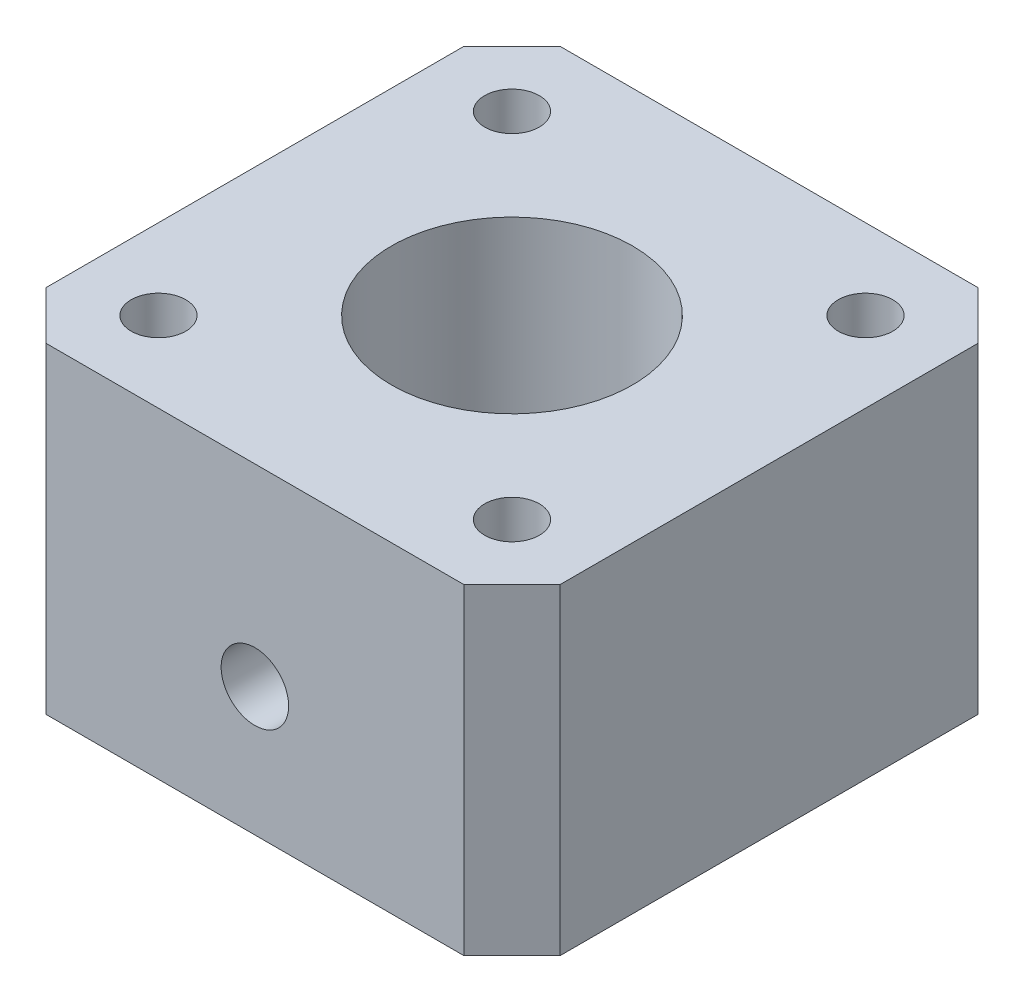
ISO-10303-21;
HEADER;
FILE_DESCRIPTION(('STEP AP214'),'2;1');
FILE_NAME('part.step','',(''),(''),'','','');
FILE_SCHEMA(('AUTOMOTIVE_DESIGN { 1 0 10303 214 1 1 1 1 }'));
ENDSEC;
DATA;
#1=APPLICATION_CONTEXT('core data for automotive mechanical design processes');
#2=APPLICATION_PROTOCOL_DEFINITION('international standard','automotive_design',2000,#1);
#3=PRODUCT_CONTEXT('',#1,'mechanical');
#4=PRODUCT('Part','Part','',(#3));
#5=PRODUCT_RELATED_PRODUCT_CATEGORY('part','',(#4));
#6=PRODUCT_DEFINITION_FORMATION('','',#4);
#7=PRODUCT_DEFINITION_CONTEXT('part definition',#1,'design');
#8=PRODUCT_DEFINITION('design','',#6,#7);
#9=PRODUCT_DEFINITION_SHAPE('','',#8);
#10=(LENGTH_UNIT() NAMED_UNIT(*) SI_UNIT(.MILLI.,.METRE.));
#11=(NAMED_UNIT(*) PLANE_ANGLE_UNIT() SI_UNIT($,.RADIAN.));
#12=(NAMED_UNIT(*) SI_UNIT($,.STERADIAN.) SOLID_ANGLE_UNIT());
#13=UNCERTAINTY_MEASURE_WITH_UNIT(LENGTH_MEASURE(1.E-05),#10,'distance_accuracy_value','');
#14=(GEOMETRIC_REPRESENTATION_CONTEXT(3) GLOBAL_UNCERTAINTY_ASSIGNED_CONTEXT((#13)) GLOBAL_UNIT_ASSIGNED_CONTEXT((#10,
#11,#12)) REPRESENTATION_CONTEXT('',''));
#15=CARTESIAN_POINT('',(0.,0.,0.));
#16=DIRECTION('',(0.,0.,1.));
#17=DIRECTION('',(1.,0.,0.));
#18=AXIS2_PLACEMENT_3D('',#15,#16,#17);
#19=CARTESIAN_POINT('',(0.,20.,0.));
#20=DIRECTION('',(0.,-1.,0.));
#21=DIRECTION('',(0.,0.,-1.));
#22=AXIS2_PLACEMENT_3D('',#19,#20,#21);
#23=PLANE('',#22);
#24=CARTESIAN_POINT('',(11.,20.,-11.));
#25=DIRECTION('',(0.,-1.,0.));
#26=DIRECTION('',(0.,0.,-1.));
#27=AXIS2_PLACEMENT_3D('',#24,#25,#26);
#28=CIRCLE('',#27,1.69999999999999);
#29=CARTESIAN_POINT('',(11.,20.,-12.7));
#30=VERTEX_POINT('',#29);
#31=EDGE_CURVE('E549',#30,#30,#28,.T.);
#32=ORIENTED_EDGE('',*,*,#31,.T.);
#33=EDGE_LOOP('',(#32));
#34=FACE_BOUND('',#33,.T.);
#35=CARTESIAN_POINT('',(-11.,20.,-11.));
#36=DIRECTION('',(0.,-1.,0.));
#37=DIRECTION('',(0.,0.,-1.));
#38=AXIS2_PLACEMENT_3D('',#35,#36,#37);
#39=CIRCLE('',#38,1.69999999999999);
#40=CARTESIAN_POINT('',(-11.,20.,-12.7));
#41=VERTEX_POINT('',#40);
#42=EDGE_CURVE('E533',#41,#41,#39,.T.);
#43=ORIENTED_EDGE('',*,*,#42,.T.);
#44=EDGE_LOOP('',(#43));
#45=FACE_BOUND('',#44,.T.);
#46=CARTESIAN_POINT('',(-11.,20.,11.));
#47=DIRECTION('',(0.,-1.,0.));
#48=DIRECTION('',(0.,0.,-1.));
#49=AXIS2_PLACEMENT_3D('',#46,#47,#48);
#50=CIRCLE('',#49,1.69999999999999);
#51=CARTESIAN_POINT('',(-11.,20.,9.30000000000001));
#52=VERTEX_POINT('',#51);
#53=EDGE_CURVE('E517',#52,#52,#50,.T.);
#54=ORIENTED_EDGE('',*,*,#53,.T.);
#55=EDGE_LOOP('',(#54));
#56=FACE_BOUND('',#55,.T.);
#57=CARTESIAN_POINT('',(11.,20.,11.));
#58=DIRECTION('',(0.,-1.,0.));
#59=DIRECTION('',(0.,0.,-1.));
#60=AXIS2_PLACEMENT_3D('',#57,#58,#59);
#61=CIRCLE('',#60,1.69999999999999);
#62=CARTESIAN_POINT('',(11.,20.,9.30000000000001));
#63=VERTEX_POINT('',#62);
#64=EDGE_CURVE('E499',#63,#63,#61,.T.);
#65=ORIENTED_EDGE('',*,*,#64,.T.);
#66=EDGE_LOOP('',(#65));
#67=FACE_BOUND('',#66,.T.);
#68=DIRECTION('',(-1.,0.,0.));
#69=VECTOR('',#68,1.);
#70=CARTESIAN_POINT('',(-13.,20.,-16.));
#71=LINE('',#70,#69);
#72=CARTESIAN_POINT('',(13.,20.,-16.));
#73=VERTEX_POINT('',#72);
#74=CARTESIAN_POINT('',(-13.,20.,-16.));
#75=VERTEX_POINT('',#74);
#76=EDGE_CURVE('E180',#73,#75,#71,.T.);
#77=ORIENTED_EDGE('',*,*,#76,.T.);
#78=DIRECTION('',(-0.707106781186547,0.,0.707106781186548));
#79=VECTOR('',#78,1.);
#80=CARTESIAN_POINT('',(-16.,20.,-13.));
#81=LINE('',#80,#79);
#82=CARTESIAN_POINT('',(-16.,20.,-13.));
#83=VERTEX_POINT('',#82);
#84=EDGE_CURVE('E116',#75,#83,#81,.T.);
#85=ORIENTED_EDGE('',*,*,#84,.T.);
#86=DIRECTION('',(0.,0.,1.));
#87=VECTOR('',#86,1.);
#88=CARTESIAN_POINT('',(-16.,20.,-13.));
#89=LINE('',#88,#87);
#90=CARTESIAN_POINT('',(-16.,20.,13.));
#91=VERTEX_POINT('',#90);
#92=EDGE_CURVE('E201',#83,#91,#89,.T.);
#93=ORIENTED_EDGE('',*,*,#92,.T.);
#94=DIRECTION('',(0.707106781186548,0.,0.707106781186547));
#95=VECTOR('',#94,1.);
#96=CARTESIAN_POINT('',(-16.,20.,13.));
#97=LINE('',#96,#95);
#98=CARTESIAN_POINT('',(-13.,20.,16.));
#99=VERTEX_POINT('',#98);
#100=EDGE_CURVE('E215',#91,#99,#97,.T.);
#101=ORIENTED_EDGE('',*,*,#100,.T.);
#102=DIRECTION('',(1.,0.,0.));
#103=VECTOR('',#102,1.);
#104=CARTESIAN_POINT('',(-13.,20.,16.));
#105=LINE('',#104,#103);
#106=CARTESIAN_POINT('',(13.,20.,16.));
#107=VERTEX_POINT('',#106);
#108=EDGE_CURVE('E135',#99,#107,#105,.T.);
#109=ORIENTED_EDGE('',*,*,#108,.T.);
#110=DIRECTION('',(0.707106781186547,0.,-0.707106781186547));
#111=VECTOR('',#110,1.);
#112=CARTESIAN_POINT('',(13.,20.,16.));
#113=LINE('',#112,#111);
#114=CARTESIAN_POINT('',(16.,20.,13.));
#115=VERTEX_POINT('',#114);
#116=EDGE_CURVE('E129',#107,#115,#113,.T.);
#117=ORIENTED_EDGE('',*,*,#116,.T.);
#118=DIRECTION('',(0.,0.,-1.));
#119=VECTOR('',#118,1.);
#120=CARTESIAN_POINT('',(16.,20.,-13.));
#121=LINE('',#120,#119);
#122=CARTESIAN_POINT('',(16.,20.,-13.));
#123=VERTEX_POINT('',#122);
#124=EDGE_CURVE('E133',#115,#123,#121,.T.);
#125=ORIENTED_EDGE('',*,*,#124,.T.);
#126=DIRECTION('',(-0.707106781186547,0.,-0.707106781186548));
#127=VECTOR('',#126,1.);
#128=CARTESIAN_POINT('',(13.,20.,-16.));
#129=LINE('',#128,#127);
#130=EDGE_CURVE('E73',#123,#73,#129,.T.);
#131=ORIENTED_EDGE('',*,*,#130,.T.);
#132=EDGE_LOOP('',(#77,#85,#93,#101,#109,#117,#125,#131));
#133=FACE_BOUND('',#132,.T.);
#134=CARTESIAN_POINT('',(0.,20.,0.));
#135=DIRECTION('',(0.,1.,0.));
#136=DIRECTION('',(0.,0.,1.));
#137=AXIS2_PLACEMENT_3D('',#134,#135,#136);
#138=CIRCLE('',#137,7.5);
#139=CARTESIAN_POINT('',(0.,20.,7.5));
#140=VERTEX_POINT('',#139);
#141=EDGE_CURVE('E162',#140,#140,#138,.T.);
#142=ORIENTED_EDGE('',*,*,#141,.F.);
#143=EDGE_LOOP('',(#142));
#144=FACE_BOUND('',#143,.T.);
#145=ADVANCED_FACE('F55',(#34,#45,#56,#67,#133,#144),#23,.F.);
#146=CARTESIAN_POINT('',(0.,0.,0.));
#147=DIRECTION('',(0.,-1.,0.));
#148=DIRECTION('',(0.,0.,-1.));
#149=AXIS2_PLACEMENT_3D('',#146,#147,#148);
#150=PLANE('',#149);
#151=CARTESIAN_POINT('',(11.,0.,-11.));
#152=DIRECTION('',(0.,-1.,0.));
#153=DIRECTION('',(0.,0.,-1.));
#154=AXIS2_PLACEMENT_3D('',#151,#152,#153);
#155=CIRCLE('',#154,3.25);
#156=CARTESIAN_POINT('',(11.,0.,-14.25));
#157=VERTEX_POINT('',#156);
#158=EDGE_CURVE('E560',#157,#157,#155,.T.);
#159=ORIENTED_EDGE('',*,*,#158,.F.);
#160=EDGE_LOOP('',(#159));
#161=FACE_BOUND('',#160,.T.);
#162=CARTESIAN_POINT('',(-11.,0.,-11.));
#163=DIRECTION('',(0.,-1.,0.));
#164=DIRECTION('',(0.,0.,-1.));
#165=AXIS2_PLACEMENT_3D('',#162,#163,#164);
#166=CIRCLE('',#165,3.25);
#167=CARTESIAN_POINT('',(-11.,0.,-14.25));
#168=VERTEX_POINT('',#167);
#169=EDGE_CURVE('E545',#168,#168,#166,.T.);
#170=ORIENTED_EDGE('',*,*,#169,.F.);
#171=EDGE_LOOP('',(#170));
#172=FACE_BOUND('',#171,.T.);
#173=CARTESIAN_POINT('',(-11.,0.,11.));
#174=DIRECTION('',(0.,-1.,0.));
#175=DIRECTION('',(0.,0.,-1.));
#176=AXIS2_PLACEMENT_3D('',#173,#174,#175);
#177=CIRCLE('',#176,3.25);
#178=CARTESIAN_POINT('',(-11.,0.,7.75000000000001));
#179=VERTEX_POINT('',#178);
#180=EDGE_CURVE('E529',#179,#179,#177,.T.);
#181=ORIENTED_EDGE('',*,*,#180,.F.);
#182=EDGE_LOOP('',(#181));
#183=FACE_BOUND('',#182,.T.);
#184=CARTESIAN_POINT('',(11.,0.,11.));
#185=DIRECTION('',(0.,-1.,0.));
#186=DIRECTION('',(0.,0.,-1.));
#187=AXIS2_PLACEMENT_3D('',#184,#185,#186);
#188=CIRCLE('',#187,3.25);
#189=CARTESIAN_POINT('',(11.,0.,7.75000000000001));
#190=VERTEX_POINT('',#189);
#191=EDGE_CURVE('E513',#190,#190,#188,.T.);
#192=ORIENTED_EDGE('',*,*,#191,.F.);
#193=EDGE_LOOP('',(#192));
#194=FACE_BOUND('',#193,.T.);
#195=DIRECTION('',(-1.,0.,0.));
#196=VECTOR('',#195,1.);
#197=CARTESIAN_POINT('',(-13.,0.,-16.));
#198=LINE('',#197,#196);
#199=CARTESIAN_POINT('',(13.,0.,-16.));
#200=VERTEX_POINT('',#199);
#201=CARTESIAN_POINT('',(-13.,0.,-16.));
#202=VERTEX_POINT('',#201);
#203=EDGE_CURVE('E157',#200,#202,#198,.T.);
#204=ORIENTED_EDGE('',*,*,#203,.F.);
#205=DIRECTION('',(-0.707106781186547,0.,-0.707106781186548));
#206=VECTOR('',#205,1.);
#207=CARTESIAN_POINT('',(13.,0.,-16.));
#208=LINE('',#207,#206);
#209=CARTESIAN_POINT('',(16.,0.,-13.));
#210=VERTEX_POINT('',#209);
#211=EDGE_CURVE('E108',#210,#200,#208,.T.);
#212=ORIENTED_EDGE('',*,*,#211,.F.);
#213=DIRECTION('',(0.,0.,-1.));
#214=VECTOR('',#213,1.);
#215=CARTESIAN_POINT('',(16.,0.,-13.));
#216=LINE('',#215,#214);
#217=CARTESIAN_POINT('',(16.,0.,13.));
#218=VERTEX_POINT('',#217);
#219=EDGE_CURVE('E102',#218,#210,#216,.T.);
#220=ORIENTED_EDGE('',*,*,#219,.F.);
#221=DIRECTION('',(0.707106781186547,0.,-0.707106781186547));
#222=VECTOR('',#221,1.);
#223=CARTESIAN_POINT('',(13.,0.,16.));
#224=LINE('',#223,#222);
#225=CARTESIAN_POINT('',(13.,0.,16.));
#226=VERTEX_POINT('',#225);
#227=EDGE_CURVE('E144',#226,#218,#224,.T.);
#228=ORIENTED_EDGE('',*,*,#227,.F.);
#229=DIRECTION('',(1.,0.,0.));
#230=VECTOR('',#229,1.);
#231=CARTESIAN_POINT('',(-13.,0.,16.));
#232=LINE('',#231,#230);
#233=CARTESIAN_POINT('',(-13.,0.,16.));
#234=VERTEX_POINT('',#233);
#235=EDGE_CURVE('E171',#234,#226,#232,.T.);
#236=ORIENTED_EDGE('',*,*,#235,.F.);
#237=DIRECTION('',(0.707106781186548,0.,0.707106781186547));
#238=VECTOR('',#237,1.);
#239=CARTESIAN_POINT('',(-16.,0.,13.));
#240=LINE('',#239,#238);
#241=CARTESIAN_POINT('',(-16.,0.,13.));
#242=VERTEX_POINT('',#241);
#243=EDGE_CURVE('E168',#242,#234,#240,.T.);
#244=ORIENTED_EDGE('',*,*,#243,.F.);
#245=DIRECTION('',(0.,0.,1.));
#246=VECTOR('',#245,1.);
#247=CARTESIAN_POINT('',(-16.,0.,-13.));
#248=LINE('',#247,#246);
#249=CARTESIAN_POINT('',(-16.,0.,-13.));
#250=VERTEX_POINT('',#249);
#251=EDGE_CURVE('E165',#250,#242,#248,.T.);
#252=ORIENTED_EDGE('',*,*,#251,.F.);
#253=DIRECTION('',(-0.707106781186547,0.,0.707106781186548));
#254=VECTOR('',#253,1.);
#255=CARTESIAN_POINT('',(-16.,0.,-13.));
#256=LINE('',#255,#254);
#257=EDGE_CURVE('E161',#202,#250,#256,.T.);
#258=ORIENTED_EDGE('',*,*,#257,.F.);
#259=EDGE_LOOP('',(#204,#212,#220,#228,#236,#244,#252,#258));
#260=FACE_BOUND('',#259,.T.);
#261=CARTESIAN_POINT('',(0.,0.,0.));
#262=DIRECTION('',(0.,1.,0.));
#263=DIRECTION('',(0.,0.,1.));
#264=AXIS2_PLACEMENT_3D('',#261,#262,#263);
#265=CIRCLE('',#264,7.5);
#266=CARTESIAN_POINT('',(0.,0.,7.5));
#267=VERTEX_POINT('',#266);
#268=EDGE_CURVE('E225',#267,#267,#265,.T.);
#269=ORIENTED_EDGE('',*,*,#268,.T.);
#270=EDGE_LOOP('',(#269));
#271=FACE_BOUND('',#270,.T.);
#272=ADVANCED_FACE('F205',(#161,#172,#183,#194,#260,#271),#150,.T.);
#273=CARTESIAN_POINT('',(-13.,20.,-16.));
#274=DIRECTION('',(0.,0.,1.));
#275=DIRECTION('',(1.,0.,0.));
#276=AXIS2_PLACEMENT_3D('',#273,#274,#275);
#277=PLANE('',#276);
#278=ORIENTED_EDGE('',*,*,#203,.T.);
#279=DIRECTION('',(0.,-1.,0.));
#280=VECTOR('',#279,1.);
#281=CARTESIAN_POINT('',(-13.,20.,-16.));
#282=LINE('',#281,#280);
#283=EDGE_CURVE('E11',#75,#202,#282,.T.);
#284=ORIENTED_EDGE('',*,*,#283,.F.);
#285=ORIENTED_EDGE('',*,*,#76,.F.);
#286=DIRECTION('',(0.,-1.,0.));
#287=VECTOR('',#286,1.);
#288=CARTESIAN_POINT('',(13.,20.,-16.));
#289=LINE('',#288,#287);
#290=EDGE_CURVE('E153',#73,#200,#289,.T.);
#291=ORIENTED_EDGE('',*,*,#290,.T.);
#292=EDGE_LOOP('',(#278,#284,#285,#291));
#293=FACE_BOUND('',#292,.T.);
#294=ADVANCED_FACE('F57',(#293),#277,.F.);
#295=CARTESIAN_POINT('',(-16.,20.,-13.));
#296=DIRECTION('',(0.707106781186548,0.,0.707106781186547));
#297=DIRECTION('',(0.707106781186547,0.,-0.707106781186548));
#298=AXIS2_PLACEMENT_3D('',#295,#296,#297);
#299=PLANE('',#298);
#300=ORIENTED_EDGE('',*,*,#257,.T.);
#301=DIRECTION('',(0.,-1.,0.));
#302=VECTOR('',#301,1.);
#303=CARTESIAN_POINT('',(-16.,20.,-13.));
#304=LINE('',#303,#302);
#305=EDGE_CURVE('E65',#83,#250,#304,.T.);
#306=ORIENTED_EDGE('',*,*,#305,.F.);
#307=ORIENTED_EDGE('',*,*,#84,.F.);
#308=ORIENTED_EDGE('',*,*,#283,.T.);
#309=EDGE_LOOP('',(#300,#306,#307,#308));
#310=FACE_BOUND('',#309,.T.);
#311=ADVANCED_FACE('F327',(#310),#299,.F.);
#312=CARTESIAN_POINT('',(-16.,20.,-13.));
#313=DIRECTION('',(1.,0.,0.));
#314=DIRECTION('',(0.,0.,-1.));
#315=AXIS2_PLACEMENT_3D('',#312,#313,#314);
#316=PLANE('',#315);
#317=ORIENTED_EDGE('',*,*,#251,.T.);
#318=DIRECTION('',(0.,-1.,0.));
#319=VECTOR('',#318,1.);
#320=CARTESIAN_POINT('',(-16.,20.,13.));
#321=LINE('',#320,#319);
#322=EDGE_CURVE('E191',#91,#242,#321,.T.);
#323=ORIENTED_EDGE('',*,*,#322,.F.);
#324=ORIENTED_EDGE('',*,*,#92,.F.);
#325=ORIENTED_EDGE('',*,*,#305,.T.);
#326=EDGE_LOOP('',(#317,#323,#324,#325));
#327=FACE_BOUND('',#326,.T.);
#328=ADVANCED_FACE('F199',(#327),#316,.F.);
#329=CARTESIAN_POINT('',(-16.,20.,13.));
#330=DIRECTION('',(0.707106781186547,0.,-0.707106781186548));
#331=DIRECTION('',(-0.707106781186548,0.,-0.707106781186547));
#332=AXIS2_PLACEMENT_3D('',#329,#330,#331);
#333=PLANE('',#332);
#334=ORIENTED_EDGE('',*,*,#243,.T.);
#335=DIRECTION('',(0.,-1.,0.));
#336=VECTOR('',#335,1.);
#337=CARTESIAN_POINT('',(-13.,20.,16.));
#338=LINE('',#337,#336);
#339=EDGE_CURVE('E187',#99,#234,#338,.T.);
#340=ORIENTED_EDGE('',*,*,#339,.F.);
#341=ORIENTED_EDGE('',*,*,#100,.F.);
#342=ORIENTED_EDGE('',*,*,#322,.T.);
#343=EDGE_LOOP('',(#334,#340,#341,#342));
#344=FACE_BOUND('',#343,.T.);
#345=ADVANCED_FACE('F210',(#344),#333,.F.);
#346=CARTESIAN_POINT('',(-13.,20.,16.));
#347=DIRECTION('',(0.,0.,-1.));
#348=DIRECTION('',(-1.,0.,0.));
#349=AXIS2_PLACEMENT_3D('',#346,#347,#348);
#350=PLANE('',#349);
#351=CARTESIAN_POINT('',(0.,8.,16.));
#352=DIRECTION('',(0.,0.,1.));
#353=DIRECTION('',(1.,0.,0.));
#354=AXIS2_PLACEMENT_3D('',#351,#352,#353);
#355=CIRCLE('',#354,2.1);
#356=CARTESIAN_POINT('',(2.1,8.,16.));
#357=VERTEX_POINT('',#356);
#358=EDGE_CURVE('E241',#357,#357,#355,.T.);
#359=ORIENTED_EDGE('',*,*,#358,.F.);
#360=EDGE_LOOP('',(#359));
#361=FACE_BOUND('',#360,.T.);
#362=ORIENTED_EDGE('',*,*,#235,.T.);
#363=DIRECTION('',(0.,-1.,0.));
#364=VECTOR('',#363,1.);
#365=CARTESIAN_POINT('',(13.,20.,16.));
#366=LINE('',#365,#364);
#367=EDGE_CURVE('E146',#107,#226,#366,.T.);
#368=ORIENTED_EDGE('',*,*,#367,.F.);
#369=ORIENTED_EDGE('',*,*,#108,.F.);
#370=ORIENTED_EDGE('',*,*,#339,.T.);
#371=EDGE_LOOP('',(#362,#368,#369,#370));
#372=FACE_BOUND('',#371,.T.);
#373=ADVANCED_FACE('F213',(#361,#372),#350,.F.);
#374=CARTESIAN_POINT('',(13.,20.,16.));
#375=DIRECTION('',(-0.707106781186548,0.,-0.707106781186548));
#376=DIRECTION('',(-0.707106781186548,0.,0.707106781186548));
#377=AXIS2_PLACEMENT_3D('',#374,#375,#376);
#378=PLANE('',#377);
#379=ORIENTED_EDGE('',*,*,#227,.T.);
#380=DIRECTION('',(0.,-1.,0.));
#381=VECTOR('',#380,1.);
#382=CARTESIAN_POINT('',(16.,20.,13.));
#383=LINE('',#382,#381);
#384=EDGE_CURVE('E141',#115,#218,#383,.T.);
#385=ORIENTED_EDGE('',*,*,#384,.F.);
#386=ORIENTED_EDGE('',*,*,#116,.F.);
#387=ORIENTED_EDGE('',*,*,#367,.T.);
#388=EDGE_LOOP('',(#379,#385,#386,#387));
#389=FACE_BOUND('',#388,.T.);
#390=ADVANCED_FACE('F142',(#389),#378,.F.);
#391=CARTESIAN_POINT('',(16.,20.,-13.));
#392=DIRECTION('',(-1.,0.,0.));
#393=DIRECTION('',(0.,0.,1.));
#394=AXIS2_PLACEMENT_3D('',#391,#392,#393);
#395=PLANE('',#394);
#396=ORIENTED_EDGE('',*,*,#219,.T.);
#397=DIRECTION('',(0.,-1.,0.));
#398=VECTOR('',#397,1.);
#399=CARTESIAN_POINT('',(16.,20.,-13.));
#400=LINE('',#399,#398);
#401=EDGE_CURVE('E147',#123,#210,#400,.T.);
#402=ORIENTED_EDGE('',*,*,#401,.F.);
#403=ORIENTED_EDGE('',*,*,#124,.F.);
#404=ORIENTED_EDGE('',*,*,#384,.T.);
#405=EDGE_LOOP('',(#396,#402,#403,#404));
#406=FACE_BOUND('',#405,.T.);
#407=ADVANCED_FACE('F149',(#406),#395,.F.);
#408=CARTESIAN_POINT('',(13.,20.,-16.));
#409=DIRECTION('',(-0.707106781186548,0.,0.707106781186547));
#410=DIRECTION('',(0.707106781186547,0.,0.707106781186548));
#411=AXIS2_PLACEMENT_3D('',#408,#409,#410);
#412=PLANE('',#411);
#413=ORIENTED_EDGE('',*,*,#211,.T.);
#414=ORIENTED_EDGE('',*,*,#290,.F.);
#415=ORIENTED_EDGE('',*,*,#130,.F.);
#416=ORIENTED_EDGE('',*,*,#401,.T.);
#417=EDGE_LOOP('',(#413,#414,#415,#416));
#418=FACE_BOUND('',#417,.T.);
#419=ADVANCED_FACE('F314',(#418),#412,.F.);
#420=CARTESIAN_POINT('',(0.,20.,0.));
#421=DIRECTION('',(0.,-1.,0.));
#422=DIRECTION('',(0.,0.,-1.));
#423=AXIS2_PLACEMENT_3D('',#420,#421,#422);
#424=CYLINDRICAL_SURFACE('',#423,7.5);
#425=CARTESIAN_POINT('',(2.1,8.,7.2));
#426=CARTESIAN_POINT('',(2.09999769142372,7.88455110517132,7.20000175092611));
#427=CARTESIAN_POINT('',(2.090447258008,7.76907857532073,7.20280713265303));
#428=CARTESIAN_POINT('',(2.05258019102824,7.5414842875502,7.21368770991474));
#429=CARTESIAN_POINT('',(2.02425538445371,7.42936401118606,7.22176520052276));
#430=CARTESIAN_POINT('',(1.94985652031882,7.21180023988363,7.24220502233453));
#431=CARTESIAN_POINT('',(1.90380916683966,7.10634697618715,7.25456090412264));
#432=CARTESIAN_POINT('',(1.79535769220004,6.90464207606648,7.28215690109494));
#433=CARTESIAN_POINT('',(1.73295183131605,6.80839141982424,7.29739732300137));
#434=CARTESIAN_POINT('',(1.59171413202466,6.62517052416384,7.32951618449188));
#435=CARTESIAN_POINT('',(1.51251149606311,6.53849155407776,7.34642599336529));
#436=CARTESIAN_POINT('',(1.34072490285875,6.37945684799169,7.37970866753021));
#437=CARTESIAN_POINT('',(1.24813943745967,6.30710272848815,7.39608147204938));
#438=CARTESIAN_POINT('',(1.0501753641818,6.177537651625,7.42679785762245));
#439=CARTESIAN_POINT('',(0.944598390212243,6.12061913539018,7.44110013563313));
#440=CARTESIAN_POINT('',(0.72490474677135,6.02545309176847,7.46570231446394));
#441=CARTESIAN_POINT('',(0.610789675797224,5.98720207950076,7.4760029622418));
#442=CARTESIAN_POINT('',(0.380302236373025,5.93140772474192,7.49121941354851));
#443=CARTESIAN_POINT('',(0.264058623362754,5.91336823938435,7.49626401123117));
#444=CARTESIAN_POINT('',(0.0300927460088075,5.89694502126617,7.50085154395726));
#445=CARTESIAN_POINT('',(-0.08762924250508,5.89855767475153,7.50039549049382));
#446=CARTESIAN_POINT('',(-0.317746311518633,5.92104988331973,7.49412619131461));
#447=CARTESIAN_POINT('',(-0.430198522887034,5.94139293966687,7.48846212582118));
#448=CARTESIAN_POINT('',(-0.650024177765258,5.99989803930804,7.47259127690994));
#449=CARTESIAN_POINT('',(-0.757397317354174,6.03806114743458,7.4623842220287));
#450=CARTESIAN_POINT('',(-0.965349801263523,6.13151539355546,7.43835884069074));
#451=CARTESIAN_POINT('',(-1.06584470618675,6.18698444930544,7.42450324668395));
#452=CARTESIAN_POINT('',(-1.25627862457918,6.31333795993753,7.39466485562083));
#453=CARTESIAN_POINT('',(-1.34621539544036,6.38422568074331,7.37868160817165));
#454=CARTESIAN_POINT('',(-1.51618305590154,6.54222754355347,7.34567522057905));
#455=CARTESIAN_POINT('',(-1.59577717509012,6.62980858410341,7.32863518998309));
#456=CARTESIAN_POINT('',(-1.73926156835205,6.81724868645204,7.29591665217892));
#457=CARTESIAN_POINT('',(-1.80315067068666,6.91710866353899,7.28023824661686));
#458=CARTESIAN_POINT('',(-1.91379030231589,7.12729666999599,7.25194501002577));
#459=CARTESIAN_POINT('',(-1.96041048527216,7.23769670572155,7.23935371206725));
#460=CARTESIAN_POINT('',(-2.03427979371574,7.46521055278396,7.21894665875122));
#461=CARTESIAN_POINT('',(-2.0615342965447,7.58232249063324,7.21112957780356));
#462=CARTESIAN_POINT('',(-2.09512133703559,7.8158226539633,7.20144181427927));
#463=CARTESIAN_POINT('',(-2.10211023295227,7.93210882732001,7.19938465899453));
#464=CARTESIAN_POINT('',(-2.09678562260949,8.16419067902114,7.20093733719562));
#465=CARTESIAN_POINT('',(-2.08447441367737,8.27998641409829,7.20454649620961));
#466=CARTESIAN_POINT('',(-2.04148011473317,8.5051921119612,7.21684386770043));
#467=CARTESIAN_POINT('',(-2.01120230768185,8.61468617743715,7.22541993924817));
#468=CARTESIAN_POINT('',(-1.93359543214541,8.82703875928599,7.24657269498035));
#469=CARTESIAN_POINT('',(-1.88626397295673,8.92989634292425,7.25914994004911));
#470=CARTESIAN_POINT('',(-1.77459509136294,9.12877269761775,7.28726240690147));
#471=CARTESIAN_POINT('',(-1.70987813502039,9.224569166007,7.30286116048027));
#472=CARTESIAN_POINT('',(-1.56573803326783,9.40418314643846,7.33511474861878));
#473=CARTESIAN_POINT('',(-1.48631183008104,9.48799816133002,7.35176980228926));
#474=CARTESIAN_POINT('',(-1.31195238316687,9.64405083657379,7.38490975407121));
#475=CARTESIAN_POINT('',(-1.21660153256647,9.71582776949724,7.4013718288206));
#476=CARTESIAN_POINT('',(-1.01482822512431,9.84236295569935,7.43172364179825));
#477=CARTESIAN_POINT('',(-0.908406353625255,9.8971221081257,7.44561351591507));
#478=CARTESIAN_POINT('',(-0.68825562093122,9.98754923511424,7.46916678636433));
#479=CARTESIAN_POINT('',(-0.574589642969956,10.0233615963978,7.47886204186584));
#480=CARTESIAN_POINT('',(-0.342537614831909,10.0752817885412,7.4930742926061));
#481=CARTESIAN_POINT('',(-0.22415273423877,10.0913944710087,7.49759256280785));
#482=CARTESIAN_POINT('',(0.00969112124072257,10.10312839472,7.50087475153958));
#483=CARTESIAN_POINT('',(0.125114144971009,10.0994223040454,7.49982757425403));
#484=CARTESIAN_POINT('',(0.353626881036669,10.0732036113851,7.49253071356722));
#485=CARTESIAN_POINT('',(0.466716697254848,10.0506918485554,7.48628126230442));
#486=CARTESIAN_POINT('',(0.68645626937514,9.98789613958341,7.46932613881606));
#487=CARTESIAN_POINT('',(0.793151611784455,9.94776095431702,7.4586578085919));
#488=CARTESIAN_POINT('',(0.998353701041716,9.85098998719994,7.43397489084363));
#489=CARTESIAN_POINT('',(1.09685921135807,9.79435171944605,7.41995979924538));
#490=CARTESIAN_POINT('',(1.28596610763476,9.66428300177141,7.38956927564246));
#491=CARTESIAN_POINT('',(1.37625788128737,9.59041564694985,7.37313745973981));
#492=CARTESIAN_POINT('',(1.54339107601341,9.42879782153954,7.3399740390093));
#493=CARTESIAN_POINT('',(1.6202288270092,9.34104357518203,7.32324235374892));
#494=CARTESIAN_POINT('',(1.7601810081138,9.15151287771814,7.29088892650895));
#495=CARTESIAN_POINT('',(1.82290552428642,9.04944137267979,7.27530525828304));
#496=CARTESIAN_POINT('',(1.93021956053794,8.83577800875938,7.24757503896698));
#497=CARTESIAN_POINT('',(1.97481976673698,8.72419180685135,7.23542646383002));
#498=CARTESIAN_POINT('',(2.03947300884321,8.51101715035091,7.2174445712127));
#499=CARTESIAN_POINT('',(2.0621139131252,8.41026176112713,7.21095909202013));
#500=CARTESIAN_POINT('',(2.09237736458971,8.20634364291426,7.20223632826998));
#501=CARTESIAN_POINT('',(2.10000206326628,8.10318126093812,7.19999843512782));
#502=CARTESIAN_POINT('',(2.1,8.,7.2));
#503=B_SPLINE_CURVE_WITH_KNOTS('',3,(#425,#426,#427,#428,#429,#430,#431,#432,#433,#434,#435,
#436,#437,#438,#439,#440,#441,#442,#443,#444,#445,#446,#447,#448,#449,#450,#451,#452,#453,#454,
#455,#456,#457,#458,#459,#460,#461,#462,#463,#464,#465,#466,#467,#468,#469,#470,#471,#472,#473,
#474,#475,#476,#477,#478,#479,#480,#481,#482,#483,#484,#485,#486,#487,#488,#489,#490,#491,#492,
#493,#494,#495,#496,#497,#498,#499,#500,#501,#502),.UNSPECIFIED.,.T.,.F.,(4,2,2,2,2,2,2,2,2,2,2,
2,2,2,2,2,2,2,2,2,2,2,2,2,2,2,2,2,2,2,2,2,2,2,2,2,2,2,4),(0.,0.345966820679476,
0.692084349409679,1.03768238213022,1.3833171840449,1.73757082880147,2.09186442676818,
2.45246381411618,2.81299585839309,3.1644693582517,3.51587822801511,3.85752460211593,
4.19919139381877,4.54449343533439,4.88986868878041,5.24690042870958,5.60395879841149,
5.96365984094947,6.3232609648655,6.67107770948494,7.01885305597464,7.35906666926101,
7.69932799470604,8.0477245112009,8.39619353426625,8.7559044767484,9.11559641039042,
9.47250627059271,9.82932821384833,10.1741178008124,10.5188920032276,10.8608102624593,
11.202780052397,11.5546053491271,11.9065264700836,12.2672217164641,12.6277039867531,
12.9369525819905,13.2461568654393),.UNSPECIFIED.);
#504=CARTESIAN_POINT('',(2.1,8.,7.2));
#505=VERTEX_POINT('',#504);
#506=EDGE_CURVE('E229',#505,#505,#503,.T.);
#507=ORIENTED_EDGE('',*,*,#506,.F.);
#508=EDGE_LOOP('',(#507));
#509=FACE_BOUND('',#508,.T.);
#510=ORIENTED_EDGE('',*,*,#141,.T.);
#511=EDGE_LOOP('',(#510));
#512=FACE_BOUND('',#511,.T.);
#513=ORIENTED_EDGE('',*,*,#268,.F.);
#514=EDGE_LOOP('',(#513));
#515=FACE_BOUND('',#514,.T.);
#516=ADVANCED_FACE('F250',(#509,#512,#515),#424,.F.);
#517=CARTESIAN_POINT('',(0.,8.,16.));
#518=DIRECTION('',(0.,0.,1.));
#519=DIRECTION('',(1.,0.,0.));
#520=AXIS2_PLACEMENT_3D('',#517,#518,#519);
#521=CYLINDRICAL_SURFACE('',#520,2.1);
#522=ORIENTED_EDGE('',*,*,#358,.T.);
#523=EDGE_LOOP('',(#522));
#524=FACE_BOUND('',#523,.T.);
#525=ORIENTED_EDGE('',*,*,#506,.T.);
#526=EDGE_LOOP('',(#525));
#527=FACE_BOUND('',#526,.T.);
#528=ADVANCED_FACE('F245',(#524,#527),#521,.F.);
#529=CARTESIAN_POINT('',(11.,0.,11.));
#530=DIRECTION('',(0.,-1.,0.));
#531=DIRECTION('',(0.,0.,-1.));
#532=AXIS2_PLACEMENT_3D('',#529,#530,#531);
#533=CYLINDRICAL_SURFACE('',#532,1.7);
#534=ORIENTED_EDGE('',*,*,#64,.F.);
#535=EDGE_LOOP('',(#534));
#536=FACE_BOUND('',#535,.T.);
#537=CARTESIAN_POINT('',(11.,3.,11.));
#538=DIRECTION('',(0.,-1.,0.));
#539=DIRECTION('',(0.,0.,-1.));
#540=AXIS2_PLACEMENT_3D('',#537,#538,#539);
#541=CIRCLE('',#540,1.7);
#542=CARTESIAN_POINT('',(11.,3.,9.3));
#543=VERTEX_POINT('',#542);
#544=EDGE_CURVE('E502',#543,#543,#541,.T.);
#545=ORIENTED_EDGE('',*,*,#544,.T.);
#546=EDGE_LOOP('',(#545));
#547=FACE_BOUND('',#546,.T.);
#548=ADVANCED_FACE('F249',(#536,#547),#533,.F.);
#549=CARTESIAN_POINT('',(12.7,3.,11.));
#550=DIRECTION('',(0.,1.,0.));
#551=DIRECTION('',(0.,0.,1.));
#552=AXIS2_PLACEMENT_3D('',#549,#550,#551);
#553=PLANE('',#552);
#554=ORIENTED_EDGE('',*,*,#544,.F.);
#555=EDGE_LOOP('',(#554));
#556=FACE_BOUND('',#555,.T.);
#557=CARTESIAN_POINT('',(11.,3.,11.));
#558=DIRECTION('',(0.,-1.,0.));
#559=DIRECTION('',(0.,0.,-1.));
#560=AXIS2_PLACEMENT_3D('',#557,#558,#559);
#561=CIRCLE('',#560,3.25);
#562=CARTESIAN_POINT('',(11.,3.,7.75000000000001));
#563=VERTEX_POINT('',#562);
#564=EDGE_CURVE('E507',#563,#563,#561,.T.);
#565=ORIENTED_EDGE('',*,*,#564,.T.);
#566=EDGE_LOOP('',(#565));
#567=FACE_BOUND('',#566,.T.);
#568=ADVANCED_FACE('F254',(#556,#567),#553,.F.);
#569=CARTESIAN_POINT('',(11.,0.,11.));
#570=DIRECTION('',(0.,-1.,0.));
#571=DIRECTION('',(0.,0.,-1.));
#572=AXIS2_PLACEMENT_3D('',#569,#570,#571);
#573=CYLINDRICAL_SURFACE('',#572,3.25);
#574=ORIENTED_EDGE('',*,*,#564,.F.);
#575=EDGE_LOOP('',(#574));
#576=FACE_BOUND('',#575,.T.);
#577=ORIENTED_EDGE('',*,*,#191,.T.);
#578=EDGE_LOOP('',(#577));
#579=FACE_BOUND('',#578,.T.);
#580=ADVANCED_FACE('F258',(#576,#579),#573,.F.);
#581=CARTESIAN_POINT('',(-11.,0.,11.));
#582=DIRECTION('',(0.,-1.,0.));
#583=DIRECTION('',(0.,0.,-1.));
#584=AXIS2_PLACEMENT_3D('',#581,#582,#583);
#585=CYLINDRICAL_SURFACE('',#584,1.7);
#586=ORIENTED_EDGE('',*,*,#53,.F.);
#587=EDGE_LOOP('',(#586));
#588=FACE_BOUND('',#587,.T.);
#589=CARTESIAN_POINT('',(-11.,3.,11.));
#590=DIRECTION('',(0.,-1.,0.));
#591=DIRECTION('',(0.,0.,-1.));
#592=AXIS2_PLACEMENT_3D('',#589,#590,#591);
#593=CIRCLE('',#592,1.7);
#594=CARTESIAN_POINT('',(-11.,3.,9.3));
#595=VERTEX_POINT('',#594);
#596=EDGE_CURVE('E521',#595,#595,#593,.T.);
#597=ORIENTED_EDGE('',*,*,#596,.T.);
#598=EDGE_LOOP('',(#597));
#599=FACE_BOUND('',#598,.T.);
#600=ADVANCED_FACE('F262',(#588,#599),#585,.F.);
#601=CARTESIAN_POINT('',(-9.3,3.,11.));
#602=DIRECTION('',(0.,1.,0.));
#603=DIRECTION('',(0.,0.,1.));
#604=AXIS2_PLACEMENT_3D('',#601,#602,#603);
#605=PLANE('',#604);
#606=ORIENTED_EDGE('',*,*,#596,.F.);
#607=EDGE_LOOP('',(#606));
#608=FACE_BOUND('',#607,.T.);
#609=CARTESIAN_POINT('',(-11.,3.,11.));
#610=DIRECTION('',(0.,-1.,0.));
#611=DIRECTION('',(0.,0.,-1.));
#612=AXIS2_PLACEMENT_3D('',#609,#610,#611);
#613=CIRCLE('',#612,3.25);
#614=CARTESIAN_POINT('',(-11.,3.,7.75000000000001));
#615=VERTEX_POINT('',#614);
#616=EDGE_CURVE('E525',#615,#615,#613,.T.);
#617=ORIENTED_EDGE('',*,*,#616,.T.);
#618=EDGE_LOOP('',(#617));
#619=FACE_BOUND('',#618,.T.);
#620=ADVANCED_FACE('F266',(#608,#619),#605,.F.);
#621=CARTESIAN_POINT('',(-11.,0.,11.));
#622=DIRECTION('',(0.,-1.,0.));
#623=DIRECTION('',(0.,0.,-1.));
#624=AXIS2_PLACEMENT_3D('',#621,#622,#623);
#625=CYLINDRICAL_SURFACE('',#624,3.25);
#626=ORIENTED_EDGE('',*,*,#616,.F.);
#627=EDGE_LOOP('',(#626));
#628=FACE_BOUND('',#627,.T.);
#629=ORIENTED_EDGE('',*,*,#180,.T.);
#630=EDGE_LOOP('',(#629));
#631=FACE_BOUND('',#630,.T.);
#632=ADVANCED_FACE('F270',(#628,#631),#625,.F.);
#633=CARTESIAN_POINT('',(-11.,0.,-11.));
#634=DIRECTION('',(0.,-1.,0.));
#635=DIRECTION('',(0.,0.,-1.));
#636=AXIS2_PLACEMENT_3D('',#633,#634,#635);
#637=CYLINDRICAL_SURFACE('',#636,1.7);
#638=ORIENTED_EDGE('',*,*,#42,.F.);
#639=EDGE_LOOP('',(#638));
#640=FACE_BOUND('',#639,.T.);
#641=CARTESIAN_POINT('',(-11.,3.,-11.));
#642=DIRECTION('',(0.,-1.,0.));
#643=DIRECTION('',(0.,0.,-1.));
#644=AXIS2_PLACEMENT_3D('',#641,#642,#643);
#645=CIRCLE('',#644,1.7);
#646=CARTESIAN_POINT('',(-11.,3.,-12.7));
#647=VERTEX_POINT('',#646);
#648=EDGE_CURVE('E537',#647,#647,#645,.T.);
#649=ORIENTED_EDGE('',*,*,#648,.T.);
#650=EDGE_LOOP('',(#649));
#651=FACE_BOUND('',#650,.T.);
#652=ADVANCED_FACE('F274',(#640,#651),#637,.F.);
#653=CARTESIAN_POINT('',(-9.3,3.,-11.));
#654=DIRECTION('',(0.,1.,0.));
#655=DIRECTION('',(0.,0.,1.));
#656=AXIS2_PLACEMENT_3D('',#653,#654,#655);
#657=PLANE('',#656);
#658=ORIENTED_EDGE('',*,*,#648,.F.);
#659=EDGE_LOOP('',(#658));
#660=FACE_BOUND('',#659,.T.);
#661=CARTESIAN_POINT('',(-11.,3.,-11.));
#662=DIRECTION('',(0.,-1.,0.));
#663=DIRECTION('',(0.,0.,-1.));
#664=AXIS2_PLACEMENT_3D('',#661,#662,#663);
#665=CIRCLE('',#664,3.25);
#666=CARTESIAN_POINT('',(-11.,3.,-14.25));
#667=VERTEX_POINT('',#666);
#668=EDGE_CURVE('E541',#667,#667,#665,.T.);
#669=ORIENTED_EDGE('',*,*,#668,.T.);
#670=EDGE_LOOP('',(#669));
#671=FACE_BOUND('',#670,.T.);
#672=ADVANCED_FACE('F278',(#660,#671),#657,.F.);
#673=CARTESIAN_POINT('',(-11.,0.,-11.));
#674=DIRECTION('',(0.,-1.,0.));
#675=DIRECTION('',(0.,0.,-1.));
#676=AXIS2_PLACEMENT_3D('',#673,#674,#675);
#677=CYLINDRICAL_SURFACE('',#676,3.25);
#678=ORIENTED_EDGE('',*,*,#668,.F.);
#679=EDGE_LOOP('',(#678));
#680=FACE_BOUND('',#679,.T.);
#681=ORIENTED_EDGE('',*,*,#169,.T.);
#682=EDGE_LOOP('',(#681));
#683=FACE_BOUND('',#682,.T.);
#684=ADVANCED_FACE('F282',(#680,#683),#677,.F.);
#685=CARTESIAN_POINT('',(11.,0.,-11.));
#686=DIRECTION('',(0.,-1.,0.));
#687=DIRECTION('',(0.,0.,-1.));
#688=AXIS2_PLACEMENT_3D('',#685,#686,#687);
#689=CYLINDRICAL_SURFACE('',#688,1.7);
#690=ORIENTED_EDGE('',*,*,#31,.F.);
#691=EDGE_LOOP('',(#690));
#692=FACE_BOUND('',#691,.T.);
#693=CARTESIAN_POINT('',(11.,3.,-11.));
#694=DIRECTION('',(0.,-1.,0.));
#695=DIRECTION('',(0.,0.,-1.));
#696=AXIS2_PLACEMENT_3D('',#693,#694,#695);
#697=CIRCLE('',#696,1.7);
#698=CARTESIAN_POINT('',(11.,3.,-12.7));
#699=VERTEX_POINT('',#698);
#700=EDGE_CURVE('E552',#699,#699,#697,.T.);
#701=ORIENTED_EDGE('',*,*,#700,.T.);
#702=EDGE_LOOP('',(#701));
#703=FACE_BOUND('',#702,.T.);
#704=ADVANCED_FACE('F286',(#692,#703),#689,.F.);
#705=CARTESIAN_POINT('',(12.7,3.,-11.));
#706=DIRECTION('',(0.,1.,0.));
#707=DIRECTION('',(0.,0.,1.));
#708=AXIS2_PLACEMENT_3D('',#705,#706,#707);
#709=PLANE('',#708);
#710=ORIENTED_EDGE('',*,*,#700,.F.);
#711=EDGE_LOOP('',(#710));
#712=FACE_BOUND('',#711,.T.);
#713=CARTESIAN_POINT('',(11.,3.,-11.));
#714=DIRECTION('',(0.,-1.,0.));
#715=DIRECTION('',(0.,0.,-1.));
#716=AXIS2_PLACEMENT_3D('',#713,#714,#715);
#717=CIRCLE('',#716,3.25);
#718=CARTESIAN_POINT('',(11.,3.,-14.25));
#719=VERTEX_POINT('',#718);
#720=EDGE_CURVE('E556',#719,#719,#717,.T.);
#721=ORIENTED_EDGE('',*,*,#720,.T.);
#722=EDGE_LOOP('',(#721));
#723=FACE_BOUND('',#722,.T.);
#724=ADVANCED_FACE('F290',(#712,#723),#709,.F.);
#725=CARTESIAN_POINT('',(11.,0.,-11.));
#726=DIRECTION('',(0.,-1.,0.));
#727=DIRECTION('',(0.,0.,-1.));
#728=AXIS2_PLACEMENT_3D('',#725,#726,#727);
#729=CYLINDRICAL_SURFACE('',#728,3.25);
#730=ORIENTED_EDGE('',*,*,#720,.F.);
#731=EDGE_LOOP('',(#730));
#732=FACE_BOUND('',#731,.T.);
#733=ORIENTED_EDGE('',*,*,#158,.T.);
#734=EDGE_LOOP('',(#733));
#735=FACE_BOUND('',#734,.T.);
#736=ADVANCED_FACE('F294',(#732,#735),#729,.F.);
#737=CLOSED_SHELL('',(#145,#272,#294,#311,#328,#345,#373,#390,#407,#419,#516,#528,#548,#568,
#580,#600,#620,#632,#652,#672,#684,#704,#724,#736));
#738=MANIFOLD_SOLID_BREP('B2',#737);
#739=ADVANCED_BREP_SHAPE_REPRESENTATION('',(#18,#738),#14);
#740=SHAPE_DEFINITION_REPRESENTATION(#9,#739);
ENDSEC;
END-ISO-10303-21;
